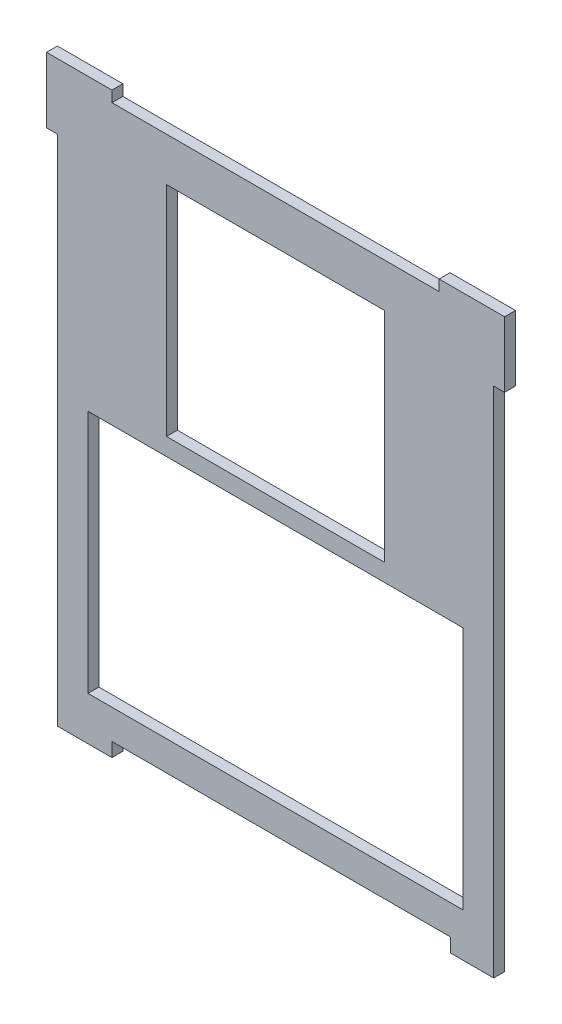
ISO-10303-21;
HEADER;
FILE_DESCRIPTION(('STEP AP214'),'2;1');
FILE_NAME('part.step','',(''),(''),'','','');
FILE_SCHEMA(('AUTOMOTIVE_DESIGN { 1 0 10303 214 1 1 1 1 }'));
ENDSEC;
DATA;
#1=APPLICATION_CONTEXT('core data for automotive mechanical design processes');
#2=APPLICATION_PROTOCOL_DEFINITION('international standard','automotive_design',2000,#1);
#3=PRODUCT_CONTEXT('',#1,'mechanical');
#4=PRODUCT('Part','Part','',(#3));
#5=PRODUCT_RELATED_PRODUCT_CATEGORY('part','',(#4));
#6=PRODUCT_DEFINITION_FORMATION('','',#4);
#7=PRODUCT_DEFINITION_CONTEXT('part definition',#1,'design');
#8=PRODUCT_DEFINITION('design','',#6,#7);
#9=PRODUCT_DEFINITION_SHAPE('','',#8);
#10=(LENGTH_UNIT() NAMED_UNIT(*) SI_UNIT(.MILLI.,.METRE.));
#11=(NAMED_UNIT(*) PLANE_ANGLE_UNIT() SI_UNIT($,.RADIAN.));
#12=(NAMED_UNIT(*) SI_UNIT($,.STERADIAN.) SOLID_ANGLE_UNIT());
#13=UNCERTAINTY_MEASURE_WITH_UNIT(LENGTH_MEASURE(1.E-05),#10,'distance_accuracy_value','');
#14=(GEOMETRIC_REPRESENTATION_CONTEXT(3) GLOBAL_UNCERTAINTY_ASSIGNED_CONTEXT((#13)) GLOBAL_UNIT_ASSIGNED_CONTEXT((#10,
#11,#12)) REPRESENTATION_CONTEXT('',''));
#15=CARTESIAN_POINT('',(0.,0.,0.));
#16=DIRECTION('',(0.,0.,1.));
#17=DIRECTION('',(1.,0.,0.));
#18=AXIS2_PLACEMENT_3D('',#15,#16,#17);
#19=CARTESIAN_POINT('',(-63.5,-88.9,3.175));
#20=DIRECTION('',(1.,0.,0.));
#21=DIRECTION('',(0.,0.,-1.));
#22=AXIS2_PLACEMENT_3D('',#19,#20,#21);
#23=PLANE('',#22);
#24=DIRECTION('',(0.,-1.,0.));
#25=VECTOR('',#24,1.);
#26=CARTESIAN_POINT('',(-63.5,-88.9,0.));
#27=LINE('',#26,#25);
#28=CARTESIAN_POINT('',(-63.5,73.025,0.));
#29=VERTEX_POINT('',#28);
#30=CARTESIAN_POINT('',(-63.5,-76.2,0.));
#31=VERTEX_POINT('',#30);
#32=EDGE_CURVE('E353',#29,#31,#27,.T.);
#33=ORIENTED_EDGE('',*,*,#32,.T.);
#34=DIRECTION('',(0.,0.,1.));
#35=VECTOR('',#34,1.);
#36=CARTESIAN_POINT('',(-63.5,-76.2,-0.00100000000000013));
#37=LINE('',#36,#35);
#38=CARTESIAN_POINT('',(-63.5,-76.2,3.175));
#39=VERTEX_POINT('',#38);
#40=EDGE_CURVE('E230',#31,#39,#37,.T.);
#41=ORIENTED_EDGE('',*,*,#40,.T.);
#42=DIRECTION('',(0.,-1.,0.));
#43=VECTOR('',#42,1.);
#44=CARTESIAN_POINT('',(-63.5,-88.9,3.175));
#45=LINE('',#44,#43);
#46=CARTESIAN_POINT('',(-63.5,73.025,3.175));
#47=VERTEX_POINT('',#46);
#48=EDGE_CURVE('E360',#47,#39,#45,.T.);
#49=ORIENTED_EDGE('',*,*,#48,.F.);
#50=DIRECTION('',(0.,0.,-1.));
#51=VECTOR('',#50,1.);
#52=CARTESIAN_POINT('',(-63.5,73.025,3.175));
#53=LINE('',#52,#51);
#54=EDGE_CURVE('E287',#47,#29,#53,.T.);
#55=ORIENTED_EDGE('',*,*,#54,.T.);
#56=EDGE_LOOP('',(#33,#41,#49,#55));
#57=FACE_BOUND('',#56,.T.);
#58=ADVANCED_FACE('F33',(#57),#23,.F.);
#59=CARTESIAN_POINT('',(63.5,-88.9,3.175));
#60=DIRECTION('',(-1.,0.,0.));
#61=DIRECTION('',(0.,0.,1.));
#62=AXIS2_PLACEMENT_3D('',#59,#60,#61);
#63=PLANE('',#62);
#64=DIRECTION('',(0.,1.,0.));
#65=VECTOR('',#64,1.);
#66=CARTESIAN_POINT('',(63.5,-88.9,3.175));
#67=LINE('',#66,#65);
#68=CARTESIAN_POINT('',(63.5,-76.2,3.175));
#69=VERTEX_POINT('',#68);
#70=CARTESIAN_POINT('',(63.5,73.025,3.175));
#71=VERTEX_POINT('',#70);
#72=EDGE_CURVE('E41',#69,#71,#67,.T.);
#73=ORIENTED_EDGE('',*,*,#72,.F.);
#74=DIRECTION('',(0.,0.,1.));
#75=VECTOR('',#74,1.);
#76=CARTESIAN_POINT('',(63.5,-76.2,-0.00100000000000013));
#77=LINE('',#76,#75);
#78=CARTESIAN_POINT('',(63.5,-76.2,0.));
#79=VERTEX_POINT('',#78);
#80=EDGE_CURVE('E221',#79,#69,#77,.T.);
#81=ORIENTED_EDGE('',*,*,#80,.F.);
#82=DIRECTION('',(0.,1.,0.));
#83=VECTOR('',#82,1.);
#84=CARTESIAN_POINT('',(63.5,-88.9,0.));
#85=LINE('',#84,#83);
#86=CARTESIAN_POINT('',(63.5,73.025,0.));
#87=VERTEX_POINT('',#86);
#88=EDGE_CURVE('E219',#79,#87,#85,.T.);
#89=ORIENTED_EDGE('',*,*,#88,.T.);
#90=DIRECTION('',(0.,0.,1.));
#91=VECTOR('',#90,1.);
#92=CARTESIAN_POINT('',(63.5,73.025,3.175));
#93=LINE('',#92,#91);
#94=EDGE_CURVE('E261',#87,#71,#93,.T.);
#95=ORIENTED_EDGE('',*,*,#94,.T.);
#96=EDGE_LOOP('',(#73,#81,#89,#95));
#97=FACE_BOUND('',#96,.T.);
#98=ADVANCED_FACE('F431',(#97),#63,.F.);
#99=CARTESIAN_POINT('',(63.5,88.9,3.175));
#100=DIRECTION('',(0.,-1.,0.));
#101=DIRECTION('',(1.,0.,0.));
#102=AXIS2_PLACEMENT_3D('',#99,#100,#101);
#103=PLANE('',#102);
#104=DIRECTION('',(-1.,0.,0.));
#105=VECTOR('',#104,1.);
#106=CARTESIAN_POINT('',(63.5,88.9,3.175));
#107=LINE('',#106,#105);
#108=CARTESIAN_POINT('',(47.625,88.9,3.175));
#109=VERTEX_POINT('',#108);
#110=CARTESIAN_POINT('',(-47.625,88.9,3.175));
#111=VERTEX_POINT('',#110);
#112=EDGE_CURVE('E11',#109,#111,#107,.T.);
#113=ORIENTED_EDGE('',*,*,#112,.F.);
#114=DIRECTION('',(0.,0.,-1.));
#115=VECTOR('',#114,1.);
#116=CARTESIAN_POINT('',(47.625,88.9,3.175));
#117=LINE('',#116,#115);
#118=CARTESIAN_POINT('',(47.625,88.9,0.));
#119=VERTEX_POINT('',#118);
#120=EDGE_CURVE('E254',#109,#119,#117,.T.);
#121=ORIENTED_EDGE('',*,*,#120,.T.);
#122=DIRECTION('',(-1.,0.,0.));
#123=VECTOR('',#122,1.);
#124=CARTESIAN_POINT('',(63.5,88.9,0.));
#125=LINE('',#124,#123);
#126=CARTESIAN_POINT('',(-47.625,88.9,0.));
#127=VERTEX_POINT('',#126);
#128=EDGE_CURVE('E36',#119,#127,#125,.T.);
#129=ORIENTED_EDGE('',*,*,#128,.T.);
#130=DIRECTION('',(0.,0.,1.));
#131=VECTOR('',#130,1.);
#132=CARTESIAN_POINT('',(-47.625,88.9,3.175));
#133=LINE('',#132,#131);
#134=EDGE_CURVE('E294',#127,#111,#133,.T.);
#135=ORIENTED_EDGE('',*,*,#134,.T.);
#136=EDGE_LOOP('',(#113,#121,#129,#135));
#137=FACE_BOUND('',#136,.T.);
#138=ADVANCED_FACE('F371',(#137),#103,.F.);
#139=CARTESIAN_POINT('',(0.,0.,3.175));
#140=DIRECTION('',(0.,0.,1.));
#141=DIRECTION('',(1.,0.,0.));
#142=AXIS2_PLACEMENT_3D('',#139,#140,#141);
#143=PLANE('',#142);
#144=DIRECTION('',(-1.,0.,0.));
#145=VECTOR('',#144,1.);
#146=CARTESIAN_POINT('',(-41.148,-72.136,3.175));
#147=LINE('',#146,#145);
#148=CARTESIAN_POINT('',(50.927,-72.136,3.175));
#149=VERTEX_POINT('',#148);
#150=CARTESIAN_POINT('',(-47.625,-72.136,3.175));
#151=VERTEX_POINT('',#150);
#152=EDGE_CURVE('E415',#149,#151,#147,.T.);
#153=ORIENTED_EDGE('',*,*,#152,.F.);
#154=DIRECTION('',(0.,1.,0.));
#155=VECTOR('',#154,1.);
#156=CARTESIAN_POINT('',(50.927,-76.2,3.175));
#157=LINE('',#156,#155);
#158=CARTESIAN_POINT('',(50.927,-76.2,3.175));
#159=VERTEX_POINT('',#158);
#160=EDGE_CURVE('E205',#159,#149,#157,.T.);
#161=ORIENTED_EDGE('',*,*,#160,.F.);
#162=DIRECTION('',(-1.,0.,0.));
#163=VECTOR('',#162,1.);
#164=CARTESIAN_POINT('',(63.5,-76.2,3.175));
#165=LINE('',#164,#163);
#166=EDGE_CURVE('E213',#69,#159,#165,.T.);
#167=ORIENTED_EDGE('',*,*,#166,.F.);
#168=ORIENTED_EDGE('',*,*,#72,.T.);
#169=DIRECTION('',(1.,0.,0.));
#170=VECTOR('',#169,1.);
#171=CARTESIAN_POINT('',(60.325,73.025,3.175));
#172=LINE('',#171,#170);
#173=CARTESIAN_POINT('',(66.675,73.025,3.175));
#174=VERTEX_POINT('',#173);
#175=EDGE_CURVE('E247',#71,#174,#172,.T.);
#176=ORIENTED_EDGE('',*,*,#175,.T.);
#177=DIRECTION('',(0.,1.,0.));
#178=VECTOR('',#177,1.);
#179=CARTESIAN_POINT('',(66.675,85.725,3.175));
#180=LINE('',#179,#178);
#181=CARTESIAN_POINT('',(66.675,92.075,3.175));
#182=VERTEX_POINT('',#181);
#183=EDGE_CURVE('E238',#174,#182,#180,.T.);
#184=ORIENTED_EDGE('',*,*,#183,.T.);
#185=DIRECTION('',(-1.,0.,0.));
#186=VECTOR('',#185,1.);
#187=CARTESIAN_POINT('',(60.325,92.075,3.175));
#188=LINE('',#187,#186);
#189=CARTESIAN_POINT('',(47.625,92.075,3.175));
#190=VERTEX_POINT('',#189);
#191=EDGE_CURVE('E233',#182,#190,#188,.T.);
#192=ORIENTED_EDGE('',*,*,#191,.T.);
#193=DIRECTION('',(0.,-1.,0.));
#194=VECTOR('',#193,1.);
#195=CARTESIAN_POINT('',(47.625,85.725,3.175));
#196=LINE('',#195,#194);
#197=EDGE_CURVE('E48',#190,#109,#196,.T.);
#198=ORIENTED_EDGE('',*,*,#197,.T.);
#199=ORIENTED_EDGE('',*,*,#112,.T.);
#200=DIRECTION('',(0.,1.,0.));
#201=VECTOR('',#200,1.);
#202=CARTESIAN_POINT('',(-47.625,92.075,3.175));
#203=LINE('',#202,#201);
#204=CARTESIAN_POINT('',(-47.625,92.075,3.175));
#205=VERTEX_POINT('',#204);
#206=EDGE_CURVE('E280',#111,#205,#203,.T.);
#207=ORIENTED_EDGE('',*,*,#206,.T.);
#208=DIRECTION('',(-1.,0.,0.));
#209=VECTOR('',#208,1.);
#210=CARTESIAN_POINT('',(-60.325,92.075,3.175));
#211=LINE('',#210,#209);
#212=CARTESIAN_POINT('',(-66.675,92.075,3.175));
#213=VERTEX_POINT('',#212);
#214=EDGE_CURVE('E268',#205,#213,#211,.T.);
#215=ORIENTED_EDGE('',*,*,#214,.T.);
#216=DIRECTION('',(0.,-1.,0.));
#217=VECTOR('',#216,1.);
#218=CARTESIAN_POINT('',(-66.675,85.725,3.175));
#219=LINE('',#218,#217);
#220=CARTESIAN_POINT('',(-66.675,73.025,3.175));
#221=VERTEX_POINT('',#220);
#222=EDGE_CURVE('E264',#213,#221,#219,.T.);
#223=ORIENTED_EDGE('',*,*,#222,.T.);
#224=DIRECTION('',(1.,0.,0.));
#225=VECTOR('',#224,1.);
#226=CARTESIAN_POINT('',(-66.675,73.025,3.175));
#227=LINE('',#226,#225);
#228=EDGE_CURVE('E277',#221,#47,#227,.T.);
#229=ORIENTED_EDGE('',*,*,#228,.T.);
#230=ORIENTED_EDGE('',*,*,#48,.T.);
#231=DIRECTION('',(-1.,0.,0.));
#232=VECTOR('',#231,1.);
#233=CARTESIAN_POINT('',(-63.5,-76.2,3.175));
#234=LINE('',#233,#232);
#235=CARTESIAN_POINT('',(-47.625,-76.2,3.175));
#236=VERTEX_POINT('',#235);
#237=EDGE_CURVE('E224',#236,#39,#234,.T.);
#238=ORIENTED_EDGE('',*,*,#237,.F.);
#239=DIRECTION('',(0.,-1.,0.));
#240=VECTOR('',#239,1.);
#241=CARTESIAN_POINT('',(-47.625,-76.2,3.175));
#242=LINE('',#241,#240);
#243=EDGE_CURVE('E408',#151,#236,#242,.T.);
#244=ORIENTED_EDGE('',*,*,#243,.F.);
#245=EDGE_LOOP('',(#153,#161,#167,#168,#176,#184,#192,#198,#199,#207,#215,#223,#229,#230,#238,#244));
#246=FACE_BOUND('',#245,.T.);
#247=DIRECTION('',(0.,-1.,0.));
#248=VECTOR('',#247,1.);
#249=CARTESIAN_POINT('',(-54.61,-63.5,3.175));
#250=LINE('',#249,#248);
#251=CARTESIAN_POINT('',(-54.61,7.62,3.175));
#252=VERTEX_POINT('',#251);
#253=CARTESIAN_POINT('',(-54.61,-63.5,3.175));
#254=VERTEX_POINT('',#253);
#255=EDGE_CURVE('E56',#252,#254,#250,.T.);
#256=ORIENTED_EDGE('',*,*,#255,.F.);
#257=DIRECTION('',(-1.,0.,0.));
#258=VECTOR('',#257,1.);
#259=CARTESIAN_POINT('',(54.61,7.62000000000002,3.175));
#260=LINE('',#259,#258);
#261=CARTESIAN_POINT('',(54.61,7.62000000000002,3.175));
#262=VERTEX_POINT('',#261);
#263=EDGE_CURVE('E301',#262,#252,#260,.T.);
#264=ORIENTED_EDGE('',*,*,#263,.F.);
#265=DIRECTION('',(0.,1.,0.));
#266=VECTOR('',#265,1.);
#267=CARTESIAN_POINT('',(54.61,-63.5,3.175));
#268=LINE('',#267,#266);
#269=CARTESIAN_POINT('',(54.61,-63.5,3.175));
#270=VERTEX_POINT('',#269);
#271=EDGE_CURVE('E315',#270,#262,#268,.T.);
#272=ORIENTED_EDGE('',*,*,#271,.F.);
#273=DIRECTION('',(1.,0.,0.));
#274=VECTOR('',#273,1.);
#275=CARTESIAN_POINT('',(54.61,-63.5,3.175));
#276=LINE('',#275,#274);
#277=EDGE_CURVE('E312',#254,#270,#276,.T.);
#278=ORIENTED_EDGE('',*,*,#277,.F.);
#279=EDGE_LOOP('',(#256,#264,#272,#278));
#280=FACE_BOUND('',#279,.T.);
#281=DIRECTION('',(0.,-1.,0.));
#282=VECTOR('',#281,1.);
#283=CARTESIAN_POINT('',(-31.75,12.7,3.175));
#284=LINE('',#283,#282);
#285=CARTESIAN_POINT('',(-31.75,76.2,3.175));
#286=VERTEX_POINT('',#285);
#287=CARTESIAN_POINT('',(-31.75,12.7,3.175));
#288=VERTEX_POINT('',#287);
#289=EDGE_CURVE('E322',#286,#288,#284,.T.);
#290=ORIENTED_EDGE('',*,*,#289,.F.);
#291=DIRECTION('',(-1.,0.,0.));
#292=VECTOR('',#291,1.);
#293=CARTESIAN_POINT('',(31.75,76.2,3.175));
#294=LINE('',#293,#292);
#295=CARTESIAN_POINT('',(31.75,76.2,3.175));
#296=VERTEX_POINT('',#295);
#297=EDGE_CURVE('E332',#296,#286,#294,.T.);
#298=ORIENTED_EDGE('',*,*,#297,.F.);
#299=DIRECTION('',(0.,1.,0.));
#300=VECTOR('',#299,1.);
#301=CARTESIAN_POINT('',(31.75,12.7,3.175));
#302=LINE('',#301,#300);
#303=CARTESIAN_POINT('',(31.75,12.7,3.175));
#304=VERTEX_POINT('',#303);
#305=EDGE_CURVE('E346',#304,#296,#302,.T.);
#306=ORIENTED_EDGE('',*,*,#305,.F.);
#307=DIRECTION('',(1.,0.,0.));
#308=VECTOR('',#307,1.);
#309=CARTESIAN_POINT('',(31.75,12.7,3.175));
#310=LINE('',#309,#308);
#311=EDGE_CURVE('E343',#288,#304,#310,.T.);
#312=ORIENTED_EDGE('',*,*,#311,.F.);
#313=EDGE_LOOP('',(#290,#298,#306,#312));
#314=FACE_BOUND('',#313,.T.);
#315=ADVANCED_FACE('F389',(#246,#280,#314),#143,.T.);
#316=CARTESIAN_POINT('',(0.,0.,0.));
#317=DIRECTION('',(0.,0.,1.));
#318=DIRECTION('',(1.,0.,0.));
#319=AXIS2_PLACEMENT_3D('',#316,#317,#318);
#320=PLANE('',#319);
#321=DIRECTION('',(0.,1.,0.));
#322=VECTOR('',#321,1.);
#323=CARTESIAN_POINT('',(50.927,-76.2,0.));
#324=LINE('',#323,#322);
#325=CARTESIAN_POINT('',(50.927,-76.2,0.));
#326=VERTEX_POINT('',#325);
#327=CARTESIAN_POINT('',(50.927,-72.136,0.));
#328=VERTEX_POINT('',#327);
#329=EDGE_CURVE('E195',#326,#328,#324,.T.);
#330=ORIENTED_EDGE('',*,*,#329,.T.);
#331=DIRECTION('',(-1.,0.,0.));
#332=VECTOR('',#331,1.);
#333=CARTESIAN_POINT('',(-41.148,-72.136,0.));
#334=LINE('',#333,#332);
#335=CARTESIAN_POINT('',(-47.625,-72.136,0.));
#336=VERTEX_POINT('',#335);
#337=EDGE_CURVE('E403',#328,#336,#334,.T.);
#338=ORIENTED_EDGE('',*,*,#337,.T.);
#339=DIRECTION('',(0.,-1.,0.));
#340=VECTOR('',#339,1.);
#341=CARTESIAN_POINT('',(-47.625,-76.2,0.));
#342=LINE('',#341,#340);
#343=CARTESIAN_POINT('',(-47.625,-76.2,0.));
#344=VERTEX_POINT('',#343);
#345=EDGE_CURVE('E402',#336,#344,#342,.T.);
#346=ORIENTED_EDGE('',*,*,#345,.T.);
#347=DIRECTION('',(1.,0.,0.));
#348=VECTOR('',#347,1.);
#349=CARTESIAN_POINT('',(-63.5,-76.2,0.));
#350=LINE('',#349,#348);
#351=EDGE_CURVE('E220',#31,#344,#350,.T.);
#352=ORIENTED_EDGE('',*,*,#351,.F.);
#353=ORIENTED_EDGE('',*,*,#32,.F.);
#354=DIRECTION('',(1.,0.,0.));
#355=VECTOR('',#354,1.);
#356=CARTESIAN_POINT('',(-66.675,73.025,0.));
#357=LINE('',#356,#355);
#358=CARTESIAN_POINT('',(-66.675,73.025,0.));
#359=VERTEX_POINT('',#358);
#360=EDGE_CURVE('E267',#359,#29,#357,.T.);
#361=ORIENTED_EDGE('',*,*,#360,.F.);
#362=DIRECTION('',(0.,-1.,0.));
#363=VECTOR('',#362,1.);
#364=CARTESIAN_POINT('',(-66.675,85.725,0.));
#365=LINE('',#364,#363);
#366=CARTESIAN_POINT('',(-66.675,92.075,0.));
#367=VERTEX_POINT('',#366);
#368=EDGE_CURVE('E265',#367,#359,#365,.T.);
#369=ORIENTED_EDGE('',*,*,#368,.F.);
#370=DIRECTION('',(-1.,0.,0.));
#371=VECTOR('',#370,1.);
#372=CARTESIAN_POINT('',(-60.325,92.075,0.));
#373=LINE('',#372,#371);
#374=CARTESIAN_POINT('',(-47.625,92.075,0.));
#375=VERTEX_POINT('',#374);
#376=EDGE_CURVE('E272',#375,#367,#373,.T.);
#377=ORIENTED_EDGE('',*,*,#376,.F.);
#378=DIRECTION('',(0.,1.,0.));
#379=VECTOR('',#378,1.);
#380=CARTESIAN_POINT('',(-47.625,92.075,0.));
#381=LINE('',#380,#379);
#382=EDGE_CURVE('E270',#127,#375,#381,.T.);
#383=ORIENTED_EDGE('',*,*,#382,.F.);
#384=ORIENTED_EDGE('',*,*,#128,.F.);
#385=DIRECTION('',(0.,-1.,0.));
#386=VECTOR('',#385,1.);
#387=CARTESIAN_POINT('',(47.625,85.725,0.));
#388=LINE('',#387,#386);
#389=CARTESIAN_POINT('',(47.625,92.075,0.));
#390=VERTEX_POINT('',#389);
#391=EDGE_CURVE('E240',#390,#119,#388,.T.);
#392=ORIENTED_EDGE('',*,*,#391,.F.);
#393=DIRECTION('',(-1.,0.,0.));
#394=VECTOR('',#393,1.);
#395=CARTESIAN_POINT('',(60.325,92.075,0.));
#396=LINE('',#395,#394);
#397=CARTESIAN_POINT('',(66.675,92.075,0.));
#398=VERTEX_POINT('',#397);
#399=EDGE_CURVE('E237',#398,#390,#396,.T.);
#400=ORIENTED_EDGE('',*,*,#399,.F.);
#401=DIRECTION('',(0.,1.,0.));
#402=VECTOR('',#401,1.);
#403=CARTESIAN_POINT('',(66.675,85.725,0.));
#404=LINE('',#403,#402);
#405=CARTESIAN_POINT('',(66.675,73.025,0.));
#406=VERTEX_POINT('',#405);
#407=EDGE_CURVE('E234',#406,#398,#404,.T.);
#408=ORIENTED_EDGE('',*,*,#407,.F.);
#409=DIRECTION('',(1.,0.,0.));
#410=VECTOR('',#409,1.);
#411=CARTESIAN_POINT('',(60.325,73.025,0.));
#412=LINE('',#411,#410);
#413=EDGE_CURVE('E242',#87,#406,#412,.T.);
#414=ORIENTED_EDGE('',*,*,#413,.F.);
#415=ORIENTED_EDGE('',*,*,#88,.F.);
#416=DIRECTION('',(1.,0.,0.));
#417=VECTOR('',#416,1.);
#418=CARTESIAN_POINT('',(63.5,-76.2,0.));
#419=LINE('',#418,#417);
#420=EDGE_CURVE('E210',#326,#79,#419,.T.);
#421=ORIENTED_EDGE('',*,*,#420,.F.);
#422=EDGE_LOOP('',(#330,#338,#346,#352,#353,#361,#369,#377,#383,#384,#392,#400,#408,#414,#415,#421));
#423=FACE_BOUND('',#422,.T.);
#424=DIRECTION('',(-1.,0.,0.));
#425=VECTOR('',#424,1.);
#426=CARTESIAN_POINT('',(54.61,7.62000000000002,0.));
#427=LINE('',#426,#425);
#428=CARTESIAN_POINT('',(54.61,7.62000000000002,0.));
#429=VERTEX_POINT('',#428);
#430=CARTESIAN_POINT('',(-54.61,7.62,0.));
#431=VERTEX_POINT('',#430);
#432=EDGE_CURVE('E307',#429,#431,#427,.T.);
#433=ORIENTED_EDGE('',*,*,#432,.T.);
#434=DIRECTION('',(0.,-1.,0.));
#435=VECTOR('',#434,1.);
#436=CARTESIAN_POINT('',(-54.61,-63.5,0.));
#437=LINE('',#436,#435);
#438=CARTESIAN_POINT('',(-54.61,-63.5,0.));
#439=VERTEX_POINT('',#438);
#440=EDGE_CURVE('E297',#431,#439,#437,.T.);
#441=ORIENTED_EDGE('',*,*,#440,.T.);
#442=DIRECTION('',(1.,0.,0.));
#443=VECTOR('',#442,1.);
#444=CARTESIAN_POINT('',(54.61,-63.5,0.));
#445=LINE('',#444,#443);
#446=CARTESIAN_POINT('',(54.61,-63.5,0.));
#447=VERTEX_POINT('',#446);
#448=EDGE_CURVE('E300',#439,#447,#445,.T.);
#449=ORIENTED_EDGE('',*,*,#448,.T.);
#450=DIRECTION('',(0.,1.,0.));
#451=VECTOR('',#450,1.);
#452=CARTESIAN_POINT('',(54.61,-63.5,0.));
#453=LINE('',#452,#451);
#454=EDGE_CURVE('E304',#447,#429,#453,.T.);
#455=ORIENTED_EDGE('',*,*,#454,.T.);
#456=EDGE_LOOP('',(#433,#441,#449,#455));
#457=FACE_BOUND('',#456,.T.);
#458=DIRECTION('',(-1.,0.,0.));
#459=VECTOR('',#458,1.);
#460=CARTESIAN_POINT('',(31.75,76.2,0.));
#461=LINE('',#460,#459);
#462=CARTESIAN_POINT('',(31.75,76.2,0.));
#463=VERTEX_POINT('',#462);
#464=CARTESIAN_POINT('',(-31.75,76.2,0.));
#465=VERTEX_POINT('',#464);
#466=EDGE_CURVE('E338',#463,#465,#461,.T.);
#467=ORIENTED_EDGE('',*,*,#466,.T.);
#468=DIRECTION('',(0.,-1.,0.));
#469=VECTOR('',#468,1.);
#470=CARTESIAN_POINT('',(-31.75,12.7,0.));
#471=LINE('',#470,#469);
#472=CARTESIAN_POINT('',(-31.75,12.7,0.));
#473=VERTEX_POINT('',#472);
#474=EDGE_CURVE('E328',#465,#473,#471,.T.);
#475=ORIENTED_EDGE('',*,*,#474,.T.);
#476=DIRECTION('',(1.,0.,0.));
#477=VECTOR('',#476,1.);
#478=CARTESIAN_POINT('',(31.75,12.7,0.));
#479=LINE('',#478,#477);
#480=CARTESIAN_POINT('',(31.75,12.7,0.));
#481=VERTEX_POINT('',#480);
#482=EDGE_CURVE('E331',#473,#481,#479,.T.);
#483=ORIENTED_EDGE('',*,*,#482,.T.);
#484=DIRECTION('',(0.,1.,0.));
#485=VECTOR('',#484,1.);
#486=CARTESIAN_POINT('',(31.75,12.7,0.));
#487=LINE('',#486,#485);
#488=EDGE_CURVE('E335',#481,#463,#487,.T.);
#489=ORIENTED_EDGE('',*,*,#488,.T.);
#490=EDGE_LOOP('',(#467,#475,#483,#489));
#491=FACE_BOUND('',#490,.T.);
#492=ADVANCED_FACE('F216',(#423,#457,#491),#320,.F.);
#493=CARTESIAN_POINT('',(-31.75,12.7,0.));
#494=DIRECTION('',(-1.,0.,0.));
#495=DIRECTION('',(0.,0.,1.));
#496=AXIS2_PLACEMENT_3D('',#493,#494,#495);
#497=PLANE('',#496);
#498=ORIENTED_EDGE('',*,*,#289,.T.);
#499=DIRECTION('',(0.,0.,1.));
#500=VECTOR('',#499,1.);
#501=CARTESIAN_POINT('',(-31.75,12.7,0.));
#502=LINE('',#501,#500);
#503=EDGE_CURVE('E341',#473,#288,#502,.T.);
#504=ORIENTED_EDGE('',*,*,#503,.F.);
#505=ORIENTED_EDGE('',*,*,#474,.F.);
#506=DIRECTION('',(0.,0.,1.));
#507=VECTOR('',#506,1.);
#508=CARTESIAN_POINT('',(-31.75,76.2,0.));
#509=LINE('',#508,#507);
#510=EDGE_CURVE('E351',#465,#286,#509,.T.);
#511=ORIENTED_EDGE('',*,*,#510,.T.);
#512=EDGE_LOOP('',(#498,#504,#505,#511));
#513=FACE_BOUND('',#512,.T.);
#514=ADVANCED_FACE('F443',(#513),#497,.F.);
#515=CARTESIAN_POINT('',(31.75,76.2,0.));
#516=DIRECTION('',(0.,1.,0.));
#517=DIRECTION('',(-1.,0.,0.));
#518=AXIS2_PLACEMENT_3D('',#515,#516,#517);
#519=PLANE('',#518);
#520=ORIENTED_EDGE('',*,*,#297,.T.);
#521=ORIENTED_EDGE('',*,*,#510,.F.);
#522=ORIENTED_EDGE('',*,*,#466,.F.);
#523=DIRECTION('',(0.,0.,1.));
#524=VECTOR('',#523,1.);
#525=CARTESIAN_POINT('',(31.75,76.2,0.));
#526=LINE('',#525,#524);
#527=EDGE_CURVE('E354',#463,#296,#526,.T.);
#528=ORIENTED_EDGE('',*,*,#527,.T.);
#529=EDGE_LOOP('',(#520,#521,#522,#528));
#530=FACE_BOUND('',#529,.T.);
#531=ADVANCED_FACE('F448',(#530),#519,.F.);
#532=CARTESIAN_POINT('',(31.75,12.7,0.));
#533=DIRECTION('',(1.,0.,0.));
#534=DIRECTION('',(0.,0.,-1.));
#535=AXIS2_PLACEMENT_3D('',#532,#533,#534);
#536=PLANE('',#535);
#537=ORIENTED_EDGE('',*,*,#305,.T.);
#538=ORIENTED_EDGE('',*,*,#527,.F.);
#539=ORIENTED_EDGE('',*,*,#488,.F.);
#540=DIRECTION('',(0.,0.,1.));
#541=VECTOR('',#540,1.);
#542=CARTESIAN_POINT('',(31.75,12.7,0.));
#543=LINE('',#542,#541);
#544=EDGE_CURVE('E356',#481,#304,#543,.T.);
#545=ORIENTED_EDGE('',*,*,#544,.T.);
#546=EDGE_LOOP('',(#537,#538,#539,#545));
#547=FACE_BOUND('',#546,.T.);
#548=ADVANCED_FACE('F454',(#547),#536,.F.);
#549=CARTESIAN_POINT('',(31.75,12.7,0.));
#550=DIRECTION('',(0.,-1.,0.));
#551=DIRECTION('',(1.,0.,0.));
#552=AXIS2_PLACEMENT_3D('',#549,#550,#551);
#553=PLANE('',#552);
#554=ORIENTED_EDGE('',*,*,#311,.T.);
#555=ORIENTED_EDGE('',*,*,#544,.F.);
#556=ORIENTED_EDGE('',*,*,#482,.F.);
#557=ORIENTED_EDGE('',*,*,#503,.T.);
#558=EDGE_LOOP('',(#554,#555,#556,#557));
#559=FACE_BOUND('',#558,.T.);
#560=ADVANCED_FACE('F450',(#559),#553,.F.);
#561=CARTESIAN_POINT('',(-54.61,-63.5,0.));
#562=DIRECTION('',(-1.,0.,0.));
#563=DIRECTION('',(0.,-1.,0.));
#564=AXIS2_PLACEMENT_3D('',#561,#562,#563);
#565=PLANE('',#564);
#566=ORIENTED_EDGE('',*,*,#255,.T.);
#567=DIRECTION('',(0.,0.,1.));
#568=VECTOR('',#567,1.);
#569=CARTESIAN_POINT('',(-54.61,-63.5,0.));
#570=LINE('',#569,#568);
#571=EDGE_CURVE('E310',#439,#254,#570,.T.);
#572=ORIENTED_EDGE('',*,*,#571,.F.);
#573=ORIENTED_EDGE('',*,*,#440,.F.);
#574=DIRECTION('',(0.,0.,1.));
#575=VECTOR('',#574,1.);
#576=CARTESIAN_POINT('',(-54.61,7.62,0.));
#577=LINE('',#576,#575);
#578=EDGE_CURVE('E320',#431,#252,#577,.T.);
#579=ORIENTED_EDGE('',*,*,#578,.T.);
#580=EDGE_LOOP('',(#566,#572,#573,#579));
#581=FACE_BOUND('',#580,.T.);
#582=ADVANCED_FACE('F453',(#581),#565,.F.);
#583=CARTESIAN_POINT('',(54.61,7.62000000000002,0.));
#584=DIRECTION('',(0.,1.,0.));
#585=DIRECTION('',(-1.,0.,0.));
#586=AXIS2_PLACEMENT_3D('',#583,#584,#585);
#587=PLANE('',#586);
#588=ORIENTED_EDGE('',*,*,#263,.T.);
#589=ORIENTED_EDGE('',*,*,#578,.F.);
#590=ORIENTED_EDGE('',*,*,#432,.F.);
#591=DIRECTION('',(0.,0.,1.));
#592=VECTOR('',#591,1.);
#593=CARTESIAN_POINT('',(54.61,7.62000000000002,0.));
#594=LINE('',#593,#592);
#595=EDGE_CURVE('E323',#429,#262,#594,.T.);
#596=ORIENTED_EDGE('',*,*,#595,.T.);
#597=EDGE_LOOP('',(#588,#589,#590,#596));
#598=FACE_BOUND('',#597,.T.);
#599=ADVANCED_FACE('F464',(#598),#587,.F.);
#600=CARTESIAN_POINT('',(54.61,-63.5,0.));
#601=DIRECTION('',(1.,0.,0.));
#602=DIRECTION('',(0.,1.,0.));
#603=AXIS2_PLACEMENT_3D('',#600,#601,#602);
#604=PLANE('',#603);
#605=ORIENTED_EDGE('',*,*,#271,.T.);
#606=ORIENTED_EDGE('',*,*,#595,.F.);
#607=ORIENTED_EDGE('',*,*,#454,.F.);
#608=DIRECTION('',(0.,0.,1.));
#609=VECTOR('',#608,1.);
#610=CARTESIAN_POINT('',(54.61,-63.5,0.));
#611=LINE('',#610,#609);
#612=EDGE_CURVE('E325',#447,#270,#611,.T.);
#613=ORIENTED_EDGE('',*,*,#612,.T.);
#614=EDGE_LOOP('',(#605,#606,#607,#613));
#615=FACE_BOUND('',#614,.T.);
#616=ADVANCED_FACE('F468',(#615),#604,.F.);
#617=CARTESIAN_POINT('',(54.61,-63.5,0.));
#618=DIRECTION('',(0.,-1.,0.));
#619=DIRECTION('',(1.,0.,0.));
#620=AXIS2_PLACEMENT_3D('',#617,#618,#619);
#621=PLANE('',#620);
#622=ORIENTED_EDGE('',*,*,#277,.T.);
#623=ORIENTED_EDGE('',*,*,#612,.F.);
#624=ORIENTED_EDGE('',*,*,#448,.F.);
#625=ORIENTED_EDGE('',*,*,#571,.T.);
#626=EDGE_LOOP('',(#622,#623,#624,#625));
#627=FACE_BOUND('',#626,.T.);
#628=ADVANCED_FACE('F465',(#627),#621,.F.);
#629=CARTESIAN_POINT('',(-47.625,92.075,0.));
#630=DIRECTION('',(1.,0.,0.));
#631=DIRECTION('',(0.,0.,-1.));
#632=AXIS2_PLACEMENT_3D('',#629,#630,#631);
#633=PLANE('',#632);
#634=ORIENTED_EDGE('',*,*,#134,.F.);
#635=ORIENTED_EDGE('',*,*,#382,.T.);
#636=DIRECTION('',(0.,0.,1.));
#637=VECTOR('',#636,1.);
#638=CARTESIAN_POINT('',(-47.625,92.075,0.));
#639=LINE('',#638,#637);
#640=EDGE_CURVE('E288',#375,#205,#639,.T.);
#641=ORIENTED_EDGE('',*,*,#640,.T.);
#642=ORIENTED_EDGE('',*,*,#206,.F.);
#643=EDGE_LOOP('',(#634,#635,#641,#642));
#644=FACE_BOUND('',#643,.T.);
#645=ADVANCED_FACE('F376',(#644),#633,.T.);
#646=CARTESIAN_POINT('',(-66.675,73.025,0.));
#647=DIRECTION('',(0.,-1.,0.));
#648=DIRECTION('',(0.,0.,-1.));
#649=AXIS2_PLACEMENT_3D('',#646,#647,#648);
#650=PLANE('',#649);
#651=ORIENTED_EDGE('',*,*,#54,.F.);
#652=ORIENTED_EDGE('',*,*,#228,.F.);
#653=DIRECTION('',(0.,0.,1.));
#654=VECTOR('',#653,1.);
#655=CARTESIAN_POINT('',(-66.675,73.025,0.));
#656=LINE('',#655,#654);
#657=EDGE_CURVE('E274',#359,#221,#656,.T.);
#658=ORIENTED_EDGE('',*,*,#657,.F.);
#659=ORIENTED_EDGE('',*,*,#360,.T.);
#660=EDGE_LOOP('',(#651,#652,#658,#659));
#661=FACE_BOUND('',#660,.T.);
#662=ADVANCED_FACE('F479',(#661),#650,.T.);
#663=CARTESIAN_POINT('',(-60.325,92.075,0.));
#664=DIRECTION('',(0.,1.,0.));
#665=DIRECTION('',(0.,0.,1.));
#666=AXIS2_PLACEMENT_3D('',#663,#664,#665);
#667=PLANE('',#666);
#668=ORIENTED_EDGE('',*,*,#214,.F.);
#669=ORIENTED_EDGE('',*,*,#640,.F.);
#670=ORIENTED_EDGE('',*,*,#376,.T.);
#671=DIRECTION('',(0.,0.,1.));
#672=VECTOR('',#671,1.);
#673=CARTESIAN_POINT('',(-66.675,92.075,0.));
#674=LINE('',#673,#672);
#675=EDGE_CURVE('E284',#367,#213,#674,.T.);
#676=ORIENTED_EDGE('',*,*,#675,.T.);
#677=EDGE_LOOP('',(#668,#669,#670,#676));
#678=FACE_BOUND('',#677,.T.);
#679=ADVANCED_FACE('F384',(#678),#667,.T.);
#680=CARTESIAN_POINT('',(-66.675,85.725,0.));
#681=DIRECTION('',(-1.,0.,0.));
#682=DIRECTION('',(0.,0.,1.));
#683=AXIS2_PLACEMENT_3D('',#680,#681,#682);
#684=PLANE('',#683);
#685=ORIENTED_EDGE('',*,*,#222,.F.);
#686=ORIENTED_EDGE('',*,*,#675,.F.);
#687=ORIENTED_EDGE('',*,*,#368,.T.);
#688=ORIENTED_EDGE('',*,*,#657,.T.);
#689=EDGE_LOOP('',(#685,#686,#687,#688));
#690=FACE_BOUND('',#689,.T.);
#691=ADVANCED_FACE('F386',(#690),#684,.T.);
#692=CARTESIAN_POINT('',(60.325,73.025,0.));
#693=DIRECTION('',(0.,-1.,0.));
#694=DIRECTION('',(0.,0.,-1.));
#695=AXIS2_PLACEMENT_3D('',#692,#693,#694);
#696=PLANE('',#695);
#697=ORIENTED_EDGE('',*,*,#94,.F.);
#698=ORIENTED_EDGE('',*,*,#413,.T.);
#699=DIRECTION('',(0.,0.,1.));
#700=VECTOR('',#699,1.);
#701=CARTESIAN_POINT('',(66.675,73.025,0.));
#702=LINE('',#701,#700);
#703=EDGE_CURVE('E251',#406,#174,#702,.T.);
#704=ORIENTED_EDGE('',*,*,#703,.T.);
#705=ORIENTED_EDGE('',*,*,#175,.F.);
#706=EDGE_LOOP('',(#697,#698,#704,#705));
#707=FACE_BOUND('',#706,.T.);
#708=ADVANCED_FACE('F478',(#707),#696,.T.);
#709=CARTESIAN_POINT('',(47.625,85.725,0.));
#710=DIRECTION('',(-1.,0.,0.));
#711=DIRECTION('',(0.,0.,1.));
#712=AXIS2_PLACEMENT_3D('',#709,#710,#711);
#713=PLANE('',#712);
#714=ORIENTED_EDGE('',*,*,#120,.F.);
#715=ORIENTED_EDGE('',*,*,#197,.F.);
#716=DIRECTION('',(0.,0.,1.));
#717=VECTOR('',#716,1.);
#718=CARTESIAN_POINT('',(47.625,92.075,0.));
#719=LINE('',#718,#717);
#720=EDGE_CURVE('E255',#390,#190,#719,.T.);
#721=ORIENTED_EDGE('',*,*,#720,.F.);
#722=ORIENTED_EDGE('',*,*,#391,.T.);
#723=EDGE_LOOP('',(#714,#715,#721,#722));
#724=FACE_BOUND('',#723,.T.);
#725=ADVANCED_FACE('F491',(#724),#713,.T.);
#726=CARTESIAN_POINT('',(66.675,85.725,0.));
#727=DIRECTION('',(1.,0.,0.));
#728=DIRECTION('',(0.,0.,-1.));
#729=AXIS2_PLACEMENT_3D('',#726,#727,#728);
#730=PLANE('',#729);
#731=ORIENTED_EDGE('',*,*,#183,.F.);
#732=ORIENTED_EDGE('',*,*,#703,.F.);
#733=ORIENTED_EDGE('',*,*,#407,.T.);
#734=DIRECTION('',(0.,0.,1.));
#735=VECTOR('',#734,1.);
#736=CARTESIAN_POINT('',(66.675,92.075,0.));
#737=LINE('',#736,#735);
#738=EDGE_CURVE('E244',#398,#182,#737,.T.);
#739=ORIENTED_EDGE('',*,*,#738,.T.);
#740=EDGE_LOOP('',(#731,#732,#733,#739));
#741=FACE_BOUND('',#740,.T.);
#742=ADVANCED_FACE('F489',(#741),#730,.T.);
#743=CARTESIAN_POINT('',(60.325,92.075,0.));
#744=DIRECTION('',(0.,1.,0.));
#745=DIRECTION('',(0.,0.,1.));
#746=AXIS2_PLACEMENT_3D('',#743,#744,#745);
#747=PLANE('',#746);
#748=ORIENTED_EDGE('',*,*,#191,.F.);
#749=ORIENTED_EDGE('',*,*,#738,.F.);
#750=ORIENTED_EDGE('',*,*,#399,.T.);
#751=ORIENTED_EDGE('',*,*,#720,.T.);
#752=EDGE_LOOP('',(#748,#749,#750,#751));
#753=FACE_BOUND('',#752,.T.);
#754=ADVANCED_FACE('F486',(#753),#747,.T.);
#755=CARTESIAN_POINT('',(-63.5,-76.2,-0.00100000000000013));
#756=DIRECTION('',(0.,1.,0.));
#757=DIRECTION('',(0.,0.,1.));
#758=AXIS2_PLACEMENT_3D('',#755,#756,#757);
#759=PLANE('',#758);
#760=ORIENTED_EDGE('',*,*,#351,.T.);
#761=DIRECTION('',(0.,0.,1.));
#762=VECTOR('',#761,1.);
#763=CARTESIAN_POINT('',(-47.625,-76.2,0.));
#764=LINE('',#763,#762);
#765=EDGE_CURVE('E410',#344,#236,#764,.T.);
#766=ORIENTED_EDGE('',*,*,#765,.T.);
#767=ORIENTED_EDGE('',*,*,#237,.T.);
#768=ORIENTED_EDGE('',*,*,#40,.F.);
#769=EDGE_LOOP('',(#760,#766,#767,#768));
#770=FACE_BOUND('',#769,.T.);
#771=ADVANCED_FACE('F398',(#770),#759,.F.);
#772=CARTESIAN_POINT('',(63.5,-76.2,-0.00100000000000013));
#773=DIRECTION('',(0.,1.,0.));
#774=DIRECTION('',(-1.,0.,0.));
#775=AXIS2_PLACEMENT_3D('',#772,#773,#774);
#776=PLANE('',#775);
#777=ORIENTED_EDGE('',*,*,#166,.T.);
#778=DIRECTION('',(0.,0.,1.));
#779=VECTOR('',#778,1.);
#780=CARTESIAN_POINT('',(50.927,-76.2,0.));
#781=LINE('',#780,#779);
#782=EDGE_CURVE('E199',#326,#159,#781,.T.);
#783=ORIENTED_EDGE('',*,*,#782,.F.);
#784=ORIENTED_EDGE('',*,*,#420,.T.);
#785=ORIENTED_EDGE('',*,*,#80,.T.);
#786=EDGE_LOOP('',(#777,#783,#784,#785));
#787=FACE_BOUND('',#786,.T.);
#788=ADVANCED_FACE('F209',(#787),#776,.F.);
#789=CARTESIAN_POINT('',(-41.148,-72.136,0.));
#790=DIRECTION('',(0.,1.,0.));
#791=DIRECTION('',(0.,0.,1.));
#792=AXIS2_PLACEMENT_3D('',#789,#790,#791);
#793=PLANE('',#792);
#794=ORIENTED_EDGE('',*,*,#152,.T.);
#795=DIRECTION('',(0.,0.,1.));
#796=VECTOR('',#795,1.);
#797=CARTESIAN_POINT('',(-47.625,-72.136,0.));
#798=LINE('',#797,#796);
#799=EDGE_CURVE('E407',#336,#151,#798,.T.);
#800=ORIENTED_EDGE('',*,*,#799,.F.);
#801=ORIENTED_EDGE('',*,*,#337,.F.);
#802=DIRECTION('',(0.,0.,1.));
#803=VECTOR('',#802,1.);
#804=CARTESIAN_POINT('',(50.927,-72.136,0.));
#805=LINE('',#804,#803);
#806=EDGE_CURVE('E202',#328,#149,#805,.T.);
#807=ORIENTED_EDGE('',*,*,#806,.T.);
#808=EDGE_LOOP('',(#794,#800,#801,#807));
#809=FACE_BOUND('',#808,.T.);
#810=ADVANCED_FACE('F419',(#809),#793,.F.);
#811=CARTESIAN_POINT('',(-47.625,-76.2,0.));
#812=DIRECTION('',(-1.,0.,0.));
#813=DIRECTION('',(0.,0.,1.));
#814=AXIS2_PLACEMENT_3D('',#811,#812,#813);
#815=PLANE('',#814);
#816=ORIENTED_EDGE('',*,*,#243,.T.);
#817=ORIENTED_EDGE('',*,*,#765,.F.);
#818=ORIENTED_EDGE('',*,*,#345,.F.);
#819=ORIENTED_EDGE('',*,*,#799,.T.);
#820=EDGE_LOOP('',(#816,#817,#818,#819));
#821=FACE_BOUND('',#820,.T.);
#822=ADVANCED_FACE('F421',(#821),#815,.F.);
#823=CARTESIAN_POINT('',(50.927,-76.2,0.));
#824=DIRECTION('',(1.,0.,0.));
#825=DIRECTION('',(0.,0.,-1.));
#826=AXIS2_PLACEMENT_3D('',#823,#824,#825);
#827=PLANE('',#826);
#828=ORIENTED_EDGE('',*,*,#160,.T.);
#829=ORIENTED_EDGE('',*,*,#806,.F.);
#830=ORIENTED_EDGE('',*,*,#329,.F.);
#831=ORIENTED_EDGE('',*,*,#782,.T.);
#832=EDGE_LOOP('',(#828,#829,#830,#831));
#833=FACE_BOUND('',#832,.T.);
#834=ADVANCED_FACE('F198',(#833),#827,.F.);
#835=CLOSED_SHELL('',(#58,#98,#138,#315,#492,#514,#531,#548,#560,#582,#599,#616,#628,#645,#662,
#679,#691,#708,#725,#742,#754,#771,#788,#810,#822,#834));
#836=MANIFOLD_SOLID_BREP('B2',#835);
#837=ADVANCED_BREP_SHAPE_REPRESENTATION('',(#18,#836),#14);
#838=SHAPE_DEFINITION_REPRESENTATION(#9,#837);
ENDSEC;
END-ISO-10303-21;
